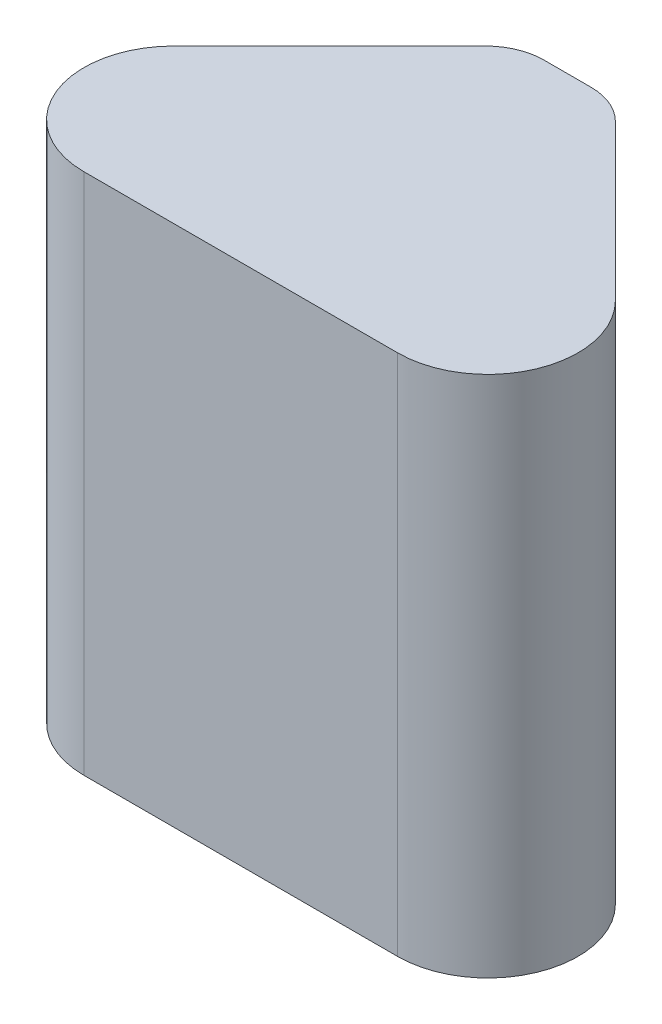
ISO-10303-21;
HEADER;
FILE_DESCRIPTION(('STEP AP214'),'2;1');
FILE_NAME('part.step','',(''),(''),'','','');
FILE_SCHEMA(('AUTOMOTIVE_DESIGN { 1 0 10303 214 1 1 1 1 }'));
ENDSEC;
DATA;
#1=APPLICATION_CONTEXT('core data for automotive mechanical design processes');
#2=APPLICATION_PROTOCOL_DEFINITION('international standard','automotive_design',2000,#1);
#3=PRODUCT_CONTEXT('',#1,'mechanical');
#4=PRODUCT('Part','Part','',(#3));
#5=PRODUCT_RELATED_PRODUCT_CATEGORY('part','',(#4));
#6=PRODUCT_DEFINITION_FORMATION('','',#4);
#7=PRODUCT_DEFINITION_CONTEXT('part definition',#1,'design');
#8=PRODUCT_DEFINITION('design','',#6,#7);
#9=PRODUCT_DEFINITION_SHAPE('','',#8);
#10=(LENGTH_UNIT() NAMED_UNIT(*) SI_UNIT(.MILLI.,.METRE.));
#11=(NAMED_UNIT(*) PLANE_ANGLE_UNIT() SI_UNIT($,.RADIAN.));
#12=(NAMED_UNIT(*) SI_UNIT($,.STERADIAN.) SOLID_ANGLE_UNIT());
#13=UNCERTAINTY_MEASURE_WITH_UNIT(LENGTH_MEASURE(1.E-05),#10,'distance_accuracy_value','');
#14=(GEOMETRIC_REPRESENTATION_CONTEXT(3) GLOBAL_UNCERTAINTY_ASSIGNED_CONTEXT((#13)) GLOBAL_UNIT_ASSIGNED_CONTEXT((#10,
#11,#12)) REPRESENTATION_CONTEXT('',''));
#15=CARTESIAN_POINT('',(0.,0.,0.));
#16=DIRECTION('',(0.,0.,1.));
#17=DIRECTION('',(1.,0.,0.));
#18=AXIS2_PLACEMENT_3D('',#15,#16,#17);
#19=CARTESIAN_POINT('',(-0.804837871961006,508.,-128.116466711811));
#20=DIRECTION('',(0.,-1.,0.));
#21=DIRECTION('',(0.,0.,-1.));
#22=AXIS2_PLACEMENT_3D('',#19,#20,#21);
#23=CYLINDRICAL_SURFACE('',#22,57.15);
#24=CARTESIAN_POINT('',(-0.804837871961006,0.,-128.116466711811));
#25=DIRECTION('',(0.,1.,0.));
#26=DIRECTION('',(0.,0.,1.));
#27=AXIS2_PLACEMENT_3D('',#24,#25,#26);
#28=CIRCLE('',#27,57.15);
#29=CARTESIAN_POINT('',(39.6063146728501,0.,-168.527619256622));
#30=VERTEX_POINT('',#29);
#31=CARTESIAN_POINT('',(-0.804837871961006,0.,-185.266466711811));
#32=VERTEX_POINT('',#31);
#33=EDGE_CURVE('E129',#30,#32,#28,.T.);
#34=ORIENTED_EDGE('',*,*,#33,.T.);
#35=DIRECTION('',(0.,-1.,0.));
#36=VECTOR('',#35,1.);
#37=CARTESIAN_POINT('',(-0.804837871961006,508.,-185.266466711811));
#38=LINE('',#37,#36);
#39=CARTESIAN_POINT('',(-0.804837871961006,508.,-185.266466711811));
#40=VERTEX_POINT('',#39);
#41=EDGE_CURVE('E11',#40,#32,#38,.T.);
#42=ORIENTED_EDGE('',*,*,#41,.F.);
#43=CARTESIAN_POINT('',(-0.804837871961006,508.,-128.116466711811));
#44=DIRECTION('',(0.,1.,0.));
#45=DIRECTION('',(0.,0.,1.));
#46=AXIS2_PLACEMENT_3D('',#43,#44,#45);
#47=CIRCLE('',#46,57.15);
#48=CARTESIAN_POINT('',(39.6063146728501,508.,-168.527619256622));
#49=VERTEX_POINT('',#48);
#50=EDGE_CURVE('E143',#49,#40,#47,.T.);
#51=ORIENTED_EDGE('',*,*,#50,.F.);
#52=DIRECTION('',(0.,-1.,0.));
#53=VECTOR('',#52,1.);
#54=CARTESIAN_POINT('',(39.6063146728501,508.,-168.527619256622));
#55=LINE('',#54,#53);
#56=EDGE_CURVE('E125',#49,#30,#55,.T.);
#57=ORIENTED_EDGE('',*,*,#56,.T.);
#58=EDGE_LOOP('',(#34,#42,#51,#57));
#59=FACE_BOUND('',#58,.T.);
#60=ADVANCED_FACE('F33',(#59),#23,.T.);
#61=CARTESIAN_POINT('',(-0.804837871961006,508.,-185.266466711811));
#62=DIRECTION('',(0.,0.,1.));
#63=DIRECTION('',(1.,0.,0.));
#64=AXIS2_PLACEMENT_3D('',#61,#62,#63);
#65=PLANE('',#64);
#66=DIRECTION('',(-1.,0.,0.));
#67=VECTOR('',#66,1.);
#68=CARTESIAN_POINT('',(-0.804837871961006,0.,-185.266466711811));
#69=LINE('',#68,#67);
#70=CARTESIAN_POINT('',(-46.4991806518336,0.,-185.266466711811));
#71=VERTEX_POINT('',#70);
#72=EDGE_CURVE('E132',#32,#71,#69,.T.);
#73=ORIENTED_EDGE('',*,*,#72,.T.);
#74=DIRECTION('',(0.,-1.,0.));
#75=VECTOR('',#74,1.);
#76=CARTESIAN_POINT('',(-46.4991806518336,508.,-185.266466711811));
#77=LINE('',#76,#75);
#78=CARTESIAN_POINT('',(-46.4991806518336,508.,-185.266466711811));
#79=VERTEX_POINT('',#78);
#80=EDGE_CURVE('E41',#79,#71,#77,.T.);
#81=ORIENTED_EDGE('',*,*,#80,.F.);
#82=DIRECTION('',(-1.,0.,0.));
#83=VECTOR('',#82,1.);
#84=CARTESIAN_POINT('',(-0.804837871961006,508.,-185.266466711811));
#85=LINE('',#84,#83);
#86=EDGE_CURVE('E92',#40,#79,#85,.T.);
#87=ORIENTED_EDGE('',*,*,#86,.F.);
#88=ORIENTED_EDGE('',*,*,#41,.T.);
#89=EDGE_LOOP('',(#73,#81,#87,#88));
#90=FACE_BOUND('',#89,.T.);
#91=ADVANCED_FACE('F178',(#90),#65,.F.);
#92=CARTESIAN_POINT('',(-46.4991806518336,508.,-128.116466711811));
#93=DIRECTION('',(0.,-1.,0.));
#94=DIRECTION('',(0.,0.,-1.));
#95=AXIS2_PLACEMENT_3D('',#92,#93,#94);
#96=CYLINDRICAL_SURFACE('',#95,57.15);
#97=CARTESIAN_POINT('',(-46.4991806518336,0.,-128.116466711811));
#98=DIRECTION('',(0.,1.,0.));
#99=DIRECTION('',(0.,0.,1.));
#100=AXIS2_PLACEMENT_3D('',#97,#98,#99);
#101=CIRCLE('',#100,57.15);
#102=CARTESIAN_POINT('',(-86.9103331966449,0.,-168.527619256622));
#103=VERTEX_POINT('',#102);
#104=EDGE_CURVE('E134',#71,#103,#101,.T.);
#105=ORIENTED_EDGE('',*,*,#104,.T.);
#106=DIRECTION('',(0.,-1.,0.));
#107=VECTOR('',#106,1.);
#108=CARTESIAN_POINT('',(-86.9103331966449,508.,-168.527619256622));
#109=LINE('',#108,#107);
#110=CARTESIAN_POINT('',(-86.9103331966449,508.,-168.527619256622));
#111=VERTEX_POINT('',#110);
#112=EDGE_CURVE('E150',#111,#103,#109,.T.);
#113=ORIENTED_EDGE('',*,*,#112,.F.);
#114=CARTESIAN_POINT('',(-46.4991806518336,508.,-128.116466711811));
#115=DIRECTION('',(0.,1.,0.));
#116=DIRECTION('',(0.,0.,1.));
#117=AXIS2_PLACEMENT_3D('',#114,#115,#116);
#118=CIRCLE('',#117,57.15);
#119=EDGE_CURVE('E158',#79,#111,#118,.T.);
#120=ORIENTED_EDGE('',*,*,#119,.F.);
#121=ORIENTED_EDGE('',*,*,#80,.T.);
#122=EDGE_LOOP('',(#105,#113,#120,#121));
#123=FACE_BOUND('',#122,.T.);
#124=ADVANCED_FACE('F156',(#123),#96,.T.);
#125=CARTESIAN_POINT('',(-86.9103331966449,508.,-168.527619256622));
#126=DIRECTION('',(0.707106781186549,0.,0.707106781186546));
#127=DIRECTION('',(0.707106781186546,0.,-0.707106781186549));
#128=AXIS2_PLACEMENT_3D('',#125,#126,#127);
#129=PLANE('',#128);
#130=DIRECTION('',(-0.707106781186546,0.,0.707106781186549));
#131=VECTOR('',#130,1.);
#132=CARTESIAN_POINT('',(-86.9103331966449,0.,-168.527619256622));
#133=LINE('',#132,#131);
#134=CARTESIAN_POINT('',(-238.077718506078,0.,-17.3602339471877));
#135=VERTEX_POINT('',#134);
#136=EDGE_CURVE('E136',#103,#135,#133,.T.);
#137=ORIENTED_EDGE('',*,*,#136,.T.);
#138=DIRECTION('',(0.,-1.,0.));
#139=VECTOR('',#138,1.);
#140=CARTESIAN_POINT('',(-238.077718506078,508.,-17.3602339471877));
#141=LINE('',#140,#139);
#142=CARTESIAN_POINT('',(-238.077718506078,508.,-17.3602339471877));
#143=VERTEX_POINT('',#142);
#144=EDGE_CURVE('E147',#143,#135,#141,.T.);
#145=ORIENTED_EDGE('',*,*,#144,.F.);
#146=DIRECTION('',(-0.707106781186546,0.,0.707106781186549));
#147=VECTOR('',#146,1.);
#148=CARTESIAN_POINT('',(-86.9103331966449,508.,-168.527619256622));
#149=LINE('',#148,#147);
#150=EDGE_CURVE('E170',#111,#143,#149,.T.);
#151=ORIENTED_EDGE('',*,*,#150,.F.);
#152=ORIENTED_EDGE('',*,*,#112,.T.);
#153=EDGE_LOOP('',(#137,#145,#151,#152));
#154=FACE_BOUND('',#153,.T.);
#155=ADVANCED_FACE('F166',(#154),#129,.F.);
#156=CARTESIAN_POINT('',(-176.113951270701,508.,44.6035332881892));
#157=DIRECTION('',(0.,-1.,0.));
#158=DIRECTION('',(0.,0.,-1.));
#159=AXIS2_PLACEMENT_3D('',#156,#157,#158);
#160=CYLINDRICAL_SURFACE('',#159,87.63);
#161=CARTESIAN_POINT('',(-176.113951270701,0.,44.6035332881892));
#162=DIRECTION('',(0.,1.,0.));
#163=DIRECTION('',(0.,0.,1.));
#164=AXIS2_PLACEMENT_3D('',#161,#162,#163);
#165=CIRCLE('',#164,87.63);
#166=CARTESIAN_POINT('',(-176.113951270701,0.,132.233533288189));
#167=VERTEX_POINT('',#166);
#168=EDGE_CURVE('E138',#135,#167,#165,.T.);
#169=ORIENTED_EDGE('',*,*,#168,.T.);
#170=DIRECTION('',(0.,-1.,0.));
#171=VECTOR('',#170,1.);
#172=CARTESIAN_POINT('',(-176.113951270701,508.,132.233533288189));
#173=LINE('',#172,#171);
#174=CARTESIAN_POINT('',(-176.113951270701,508.,132.233533288189));
#175=VERTEX_POINT('',#174);
#176=EDGE_CURVE('E120',#175,#167,#173,.T.);
#177=ORIENTED_EDGE('',*,*,#176,.F.);
#178=CARTESIAN_POINT('',(-176.113951270701,508.,44.6035332881892));
#179=DIRECTION('',(0.,1.,0.));
#180=DIRECTION('',(0.,0.,1.));
#181=AXIS2_PLACEMENT_3D('',#178,#179,#180);
#182=CIRCLE('',#181,87.63);
#183=EDGE_CURVE('E111',#143,#175,#182,.T.);
#184=ORIENTED_EDGE('',*,*,#183,.F.);
#185=ORIENTED_EDGE('',*,*,#144,.T.);
#186=EDGE_LOOP('',(#169,#177,#184,#185));
#187=FACE_BOUND('',#186,.T.);
#188=ADVANCED_FACE('F169',(#187),#160,.T.);
#189=CARTESIAN_POINT('',(-176.113951270701,508.,132.233533288189));
#190=DIRECTION('',(0.,0.,-1.));
#191=DIRECTION('',(-1.,0.,0.));
#192=AXIS2_PLACEMENT_3D('',#189,#190,#191);
#193=PLANE('',#192);
#194=DIRECTION('',(1.,0.,0.));
#195=VECTOR('',#194,1.);
#196=CARTESIAN_POINT('',(-176.113951270701,0.,132.233533288189));
#197=LINE('',#196,#195);
#198=CARTESIAN_POINT('',(128.809932746908,0.,132.233533288189));
#199=VERTEX_POINT('',#198);
#200=EDGE_CURVE('E119',#167,#199,#197,.T.);
#201=ORIENTED_EDGE('',*,*,#200,.T.);
#202=DIRECTION('',(0.,-1.,0.));
#203=VECTOR('',#202,1.);
#204=CARTESIAN_POINT('',(128.809932746908,508.,132.233533288189));
#205=LINE('',#204,#203);
#206=CARTESIAN_POINT('',(128.809932746908,508.,132.233533288189));
#207=VERTEX_POINT('',#206);
#208=EDGE_CURVE('E116',#207,#199,#205,.T.);
#209=ORIENTED_EDGE('',*,*,#208,.F.);
#210=DIRECTION('',(1.,0.,0.));
#211=VECTOR('',#210,1.);
#212=CARTESIAN_POINT('',(-176.113951270701,508.,132.233533288189));
#213=LINE('',#212,#211);
#214=EDGE_CURVE('E105',#175,#207,#213,.T.);
#215=ORIENTED_EDGE('',*,*,#214,.F.);
#216=ORIENTED_EDGE('',*,*,#176,.T.);
#217=EDGE_LOOP('',(#201,#209,#215,#216));
#218=FACE_BOUND('',#217,.T.);
#219=ADVANCED_FACE('F117',(#218),#193,.F.);
#220=CARTESIAN_POINT('',(128.809932746908,508.,44.6035332881892));
#221=DIRECTION('',(0.,-1.,0.));
#222=DIRECTION('',(0.,0.,-1.));
#223=AXIS2_PLACEMENT_3D('',#220,#221,#222);
#224=CYLINDRICAL_SURFACE('',#223,87.63);
#225=CARTESIAN_POINT('',(128.809932746908,0.,44.6035332881892));
#226=DIRECTION('',(0.,1.,0.));
#227=DIRECTION('',(0.,0.,1.));
#228=AXIS2_PLACEMENT_3D('',#225,#226,#227);
#229=CIRCLE('',#228,87.63);
#230=CARTESIAN_POINT('',(190.773699982285,0.,-17.3602339471881));
#231=VERTEX_POINT('',#230);
#232=EDGE_CURVE('E78',#199,#231,#229,.T.);
#233=ORIENTED_EDGE('',*,*,#232,.T.);
#234=DIRECTION('',(0.,-1.,0.));
#235=VECTOR('',#234,1.);
#236=CARTESIAN_POINT('',(190.773699982285,508.,-17.3602339471881));
#237=LINE('',#236,#235);
#238=CARTESIAN_POINT('',(190.773699982285,508.,-17.3602339471881));
#239=VERTEX_POINT('',#238);
#240=EDGE_CURVE('E121',#239,#231,#237,.T.);
#241=ORIENTED_EDGE('',*,*,#240,.F.);
#242=CARTESIAN_POINT('',(128.809932746908,508.,44.6035332881892));
#243=DIRECTION('',(0.,1.,0.));
#244=DIRECTION('',(0.,0.,1.));
#245=AXIS2_PLACEMENT_3D('',#242,#243,#244);
#246=CIRCLE('',#245,87.63);
#247=EDGE_CURVE('E109',#207,#239,#246,.T.);
#248=ORIENTED_EDGE('',*,*,#247,.F.);
#249=ORIENTED_EDGE('',*,*,#208,.T.);
#250=EDGE_LOOP('',(#233,#241,#248,#249));
#251=FACE_BOUND('',#250,.T.);
#252=ADVANCED_FACE('F123',(#251),#224,.T.);
#253=CARTESIAN_POINT('',(190.773699982285,508.,-17.3602339471881));
#254=DIRECTION('',(-0.707106781186546,0.,0.707106781186549));
#255=DIRECTION('',(0.707106781186549,0.,0.707106781186546));
#256=AXIS2_PLACEMENT_3D('',#253,#254,#255);
#257=PLANE('',#256);
#258=DIRECTION('',(-0.707106781186549,0.,-0.707106781186546));
#259=VECTOR('',#258,1.);
#260=CARTESIAN_POINT('',(190.773699982285,0.,-17.3602339471881));
#261=LINE('',#260,#259);
#262=EDGE_CURVE('E84',#231,#30,#261,.T.);
#263=ORIENTED_EDGE('',*,*,#262,.T.);
#264=ORIENTED_EDGE('',*,*,#56,.F.);
#265=DIRECTION('',(-0.707106781186549,0.,-0.707106781186546));
#266=VECTOR('',#265,1.);
#267=CARTESIAN_POINT('',(190.773699982285,508.,-17.3602339471881));
#268=LINE('',#267,#266);
#269=EDGE_CURVE('E49',#239,#49,#268,.T.);
#270=ORIENTED_EDGE('',*,*,#269,.F.);
#271=ORIENTED_EDGE('',*,*,#240,.T.);
#272=EDGE_LOOP('',(#263,#264,#270,#271));
#273=FACE_BOUND('',#272,.T.);
#274=ADVANCED_FACE('F194',(#273),#257,.F.);
#275=CARTESIAN_POINT('',(-0.804837871961006,508.,-128.116466711811));
#276=DIRECTION('',(0.,1.,0.));
#277=DIRECTION('',(0.,0.,1.));
#278=AXIS2_PLACEMENT_3D('',#275,#276,#277);
#279=PLANE('',#278);
#280=ORIENTED_EDGE('',*,*,#50,.T.);
#281=ORIENTED_EDGE('',*,*,#86,.T.);
#282=ORIENTED_EDGE('',*,*,#119,.T.);
#283=ORIENTED_EDGE('',*,*,#150,.T.);
#284=ORIENTED_EDGE('',*,*,#183,.T.);
#285=ORIENTED_EDGE('',*,*,#214,.T.);
#286=ORIENTED_EDGE('',*,*,#247,.T.);
#287=ORIENTED_EDGE('',*,*,#269,.T.);
#288=EDGE_LOOP('',(#280,#281,#282,#283,#284,#285,#286,#287));
#289=FACE_BOUND('',#288,.T.);
#290=ADVANCED_FACE('F107',(#289),#279,.T.);
#291=CARTESIAN_POINT('',(-0.804837871961006,0.,-128.116466711811));
#292=DIRECTION('',(0.,1.,0.));
#293=DIRECTION('',(0.,0.,1.));
#294=AXIS2_PLACEMENT_3D('',#291,#292,#293);
#295=PLANE('',#294);
#296=ORIENTED_EDGE('',*,*,#33,.F.);
#297=ORIENTED_EDGE('',*,*,#262,.F.);
#298=ORIENTED_EDGE('',*,*,#232,.F.);
#299=ORIENTED_EDGE('',*,*,#200,.F.);
#300=ORIENTED_EDGE('',*,*,#168,.F.);
#301=ORIENTED_EDGE('',*,*,#136,.F.);
#302=ORIENTED_EDGE('',*,*,#104,.F.);
#303=ORIENTED_EDGE('',*,*,#72,.F.);
#304=EDGE_LOOP('',(#296,#297,#298,#299,#300,#301,#302,#303));
#305=FACE_BOUND('',#304,.T.);
#306=ADVANCED_FACE('F162',(#305),#295,.F.);
#307=CLOSED_SHELL('',(#60,#91,#124,#155,#188,#219,#252,#274,#290,#306));
#308=MANIFOLD_SOLID_BREP('B2',#307);
#309=ADVANCED_BREP_SHAPE_REPRESENTATION('',(#18,#308),#14);
#310=SHAPE_DEFINITION_REPRESENTATION(#9,#309);
ENDSEC;
END-ISO-10303-21;
